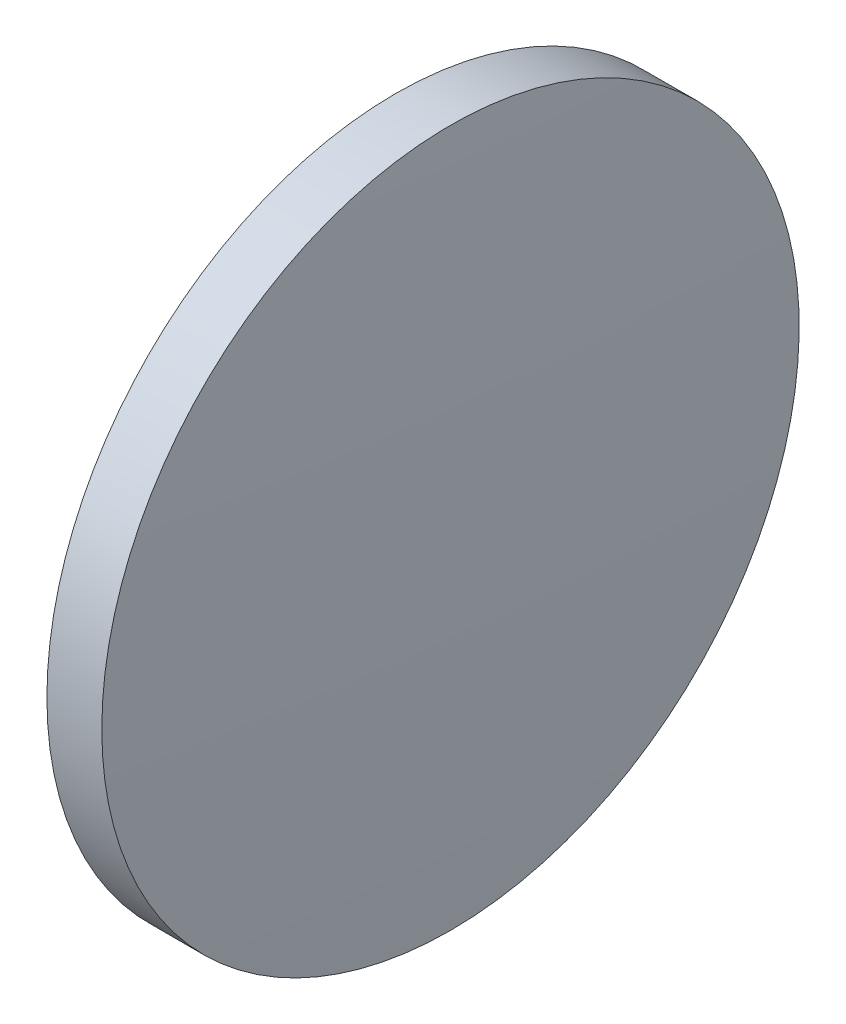
ISO-10303-21;
HEADER;
FILE_DESCRIPTION(('STEP AP214'),'2;1');
FILE_NAME('part.step','',(''),(''),'','','');
FILE_SCHEMA(('AUTOMOTIVE_DESIGN { 1 0 10303 214 1 1 1 1 }'));
ENDSEC;
DATA;
#1=APPLICATION_CONTEXT('core data for automotive mechanical design processes');
#2=APPLICATION_PROTOCOL_DEFINITION('international standard','automotive_design',2000,#1);
#3=PRODUCT_CONTEXT('',#1,'mechanical');
#4=PRODUCT('Part','Part','',(#3));
#5=PRODUCT_RELATED_PRODUCT_CATEGORY('part','',(#4));
#6=PRODUCT_DEFINITION_FORMATION('','',#4);
#7=PRODUCT_DEFINITION_CONTEXT('part definition',#1,'design');
#8=PRODUCT_DEFINITION('design','',#6,#7);
#9=PRODUCT_DEFINITION_SHAPE('','',#8);
#10=(LENGTH_UNIT() NAMED_UNIT(*) SI_UNIT(.MILLI.,.METRE.));
#11=(NAMED_UNIT(*) PLANE_ANGLE_UNIT() SI_UNIT($,.RADIAN.));
#12=(NAMED_UNIT(*) SI_UNIT($,.STERADIAN.) SOLID_ANGLE_UNIT());
#13=UNCERTAINTY_MEASURE_WITH_UNIT(LENGTH_MEASURE(1.E-05),#10,'distance_accuracy_value','');
#14=(GEOMETRIC_REPRESENTATION_CONTEXT(3) GLOBAL_UNCERTAINTY_ASSIGNED_CONTEXT((#13)) GLOBAL_UNIT_ASSIGNED_CONTEXT((#10,
#11,#12)) REPRESENTATION_CONTEXT('',''));
#15=CARTESIAN_POINT('',(0.,0.,0.));
#16=DIRECTION('',(0.,0.,1.));
#17=DIRECTION('',(1.,0.,0.));
#18=AXIS2_PLACEMENT_3D('',#15,#16,#17);
#19=CARTESIAN_POINT('',(353.855979600299,48.616113023184,0.));
#20=DIRECTION('',(-1.,0.,0.));
#21=DIRECTION('',(0.,1.,0.));
#22=AXIS2_PLACEMENT_3D('',#19,#20,#21);
#23=SPHERICAL_SURFACE('',#22,268.697757825637);
#24=CARTESIAN_POINT('',(85.4585223460911,48.6161130231848,0.));
#25=DIRECTION('',(-1.,0.,0.));
#26=DIRECTION('',(0.,0.,1.));
#27=AXIS2_PLACEMENT_3D('',#24,#25,#26);
#28=CIRCLE('',#27,12.7);
#29=CARTESIAN_POINT('',(85.4585223460911,48.6161130231848,12.7));
#30=VERTEX_POINT('',#29);
#31=EDGE_CURVE('E41',#30,#30,#28,.T.);
#32=ORIENTED_EDGE('',*,*,#31,.T.);
#33=EDGE_LOOP('',(#32));
#34=FACE_BOUND('',#33,.T.);
#35=ADVANCED_FACE('F35',(#34),#23,.T.);
#36=CARTESIAN_POINT('',(-180.939592050901,48.6161130231857,0.));
#37=DIRECTION('',(-1.,0.,0.));
#38=DIRECTION('',(0.,-1.,0.));
#39=AXIS2_PLACEMENT_3D('',#36,#37,#38);
#40=SPHERICAL_SURFACE('',#39,268.697757825563);
#41=CARTESIAN_POINT('',(87.457865203234,48.6161130231848,0.));
#42=DIRECTION('',(-1.,0.,0.));
#43=DIRECTION('',(0.,0.,1.));
#44=AXIS2_PLACEMENT_3D('',#41,#42,#43);
#45=CIRCLE('',#44,12.7);
#46=CARTESIAN_POINT('',(87.457865203234,48.6161130231848,12.7));
#47=VERTEX_POINT('',#46);
#48=EDGE_CURVE('E10',#47,#47,#45,.T.);
#49=ORIENTED_EDGE('',*,*,#48,.F.);
#50=EDGE_LOOP('',(#49));
#51=FACE_BOUND('',#50,.T.);
#52=ADVANCED_FACE('F50',(#51),#40,.T.);
#53=CARTESIAN_POINT('',(79.3054013508372,48.6161130231848,0.));
#54=DIRECTION('',(-1.,0.,0.));
#55=DIRECTION('',(0.,0.,1.));
#56=AXIS2_PLACEMENT_3D('',#53,#54,#55);
#57=CYLINDRICAL_SURFACE('',#56,12.7);
#58=ORIENTED_EDGE('',*,*,#48,.T.);
#59=EDGE_LOOP('',(#58));
#60=FACE_BOUND('',#59,.T.);
#61=ORIENTED_EDGE('',*,*,#31,.F.);
#62=EDGE_LOOP('',(#61));
#63=FACE_BOUND('',#62,.T.);
#64=ADVANCED_FACE('F48',(#60,#63),#57,.T.);
#65=CLOSED_SHELL('',(#35,#52,#64));
#66=MANIFOLD_SOLID_BREP('B2',#65);
#67=ADVANCED_BREP_SHAPE_REPRESENTATION('',(#18,#66),#14);
#68=SHAPE_DEFINITION_REPRESENTATION(#9,#67);
ENDSEC;
END-ISO-10303-21;
